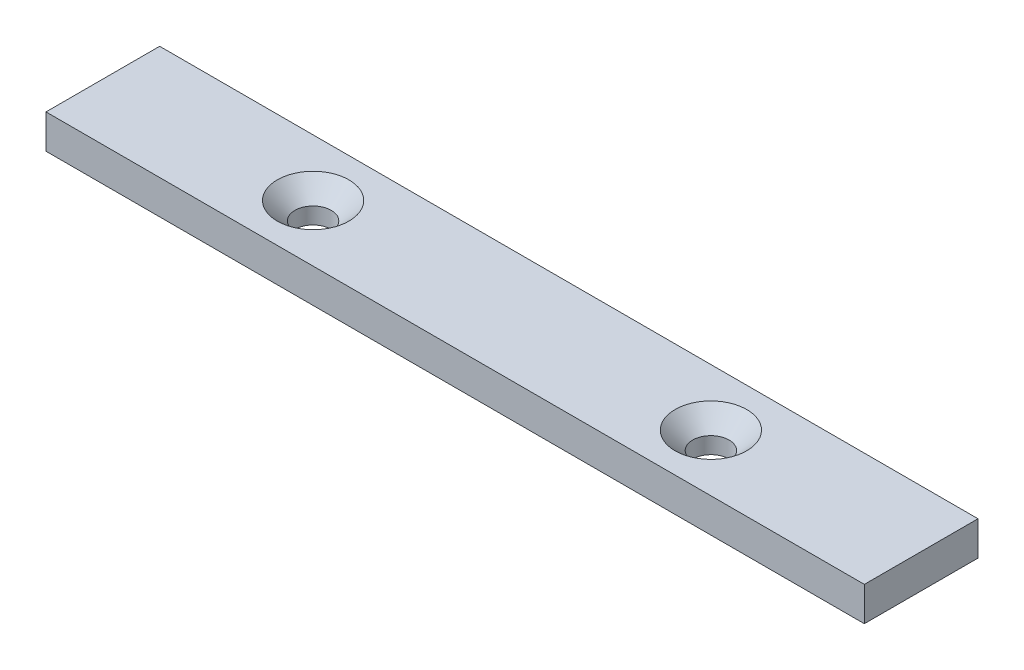
ISO-10303-21;
HEADER;
FILE_DESCRIPTION(('STEP AP214'),'2;1');
FILE_NAME('part.step','',(''),(''),'','','');
FILE_SCHEMA(('AUTOMOTIVE_DESIGN { 1 0 10303 214 1 1 1 1 }'));
ENDSEC;
DATA;
#1=APPLICATION_CONTEXT('core data for automotive mechanical design processes');
#2=APPLICATION_PROTOCOL_DEFINITION('international standard','automotive_design',2000,#1);
#3=PRODUCT_CONTEXT('',#1,'mechanical');
#4=PRODUCT('Part','Part','',(#3));
#5=PRODUCT_RELATED_PRODUCT_CATEGORY('part','',(#4));
#6=PRODUCT_DEFINITION_FORMATION('','',#4);
#7=PRODUCT_DEFINITION_CONTEXT('part definition',#1,'design');
#8=PRODUCT_DEFINITION('design','',#6,#7);
#9=PRODUCT_DEFINITION_SHAPE('','',#8);
#10=(LENGTH_UNIT() NAMED_UNIT(*) SI_UNIT(.MILLI.,.METRE.));
#11=(NAMED_UNIT(*) PLANE_ANGLE_UNIT() SI_UNIT($,.RADIAN.));
#12=(NAMED_UNIT(*) SI_UNIT($,.STERADIAN.) SOLID_ANGLE_UNIT());
#13=UNCERTAINTY_MEASURE_WITH_UNIT(LENGTH_MEASURE(1.E-05),#10,'distance_accuracy_value','');
#14=(GEOMETRIC_REPRESENTATION_CONTEXT(3) GLOBAL_UNCERTAINTY_ASSIGNED_CONTEXT((#13)) GLOBAL_UNIT_ASSIGNED_CONTEXT((#10,
#11,#12)) REPRESENTATION_CONTEXT('',''));
#15=CARTESIAN_POINT('',(0.,0.,0.));
#16=DIRECTION('',(0.,0.,1.));
#17=DIRECTION('',(1.,0.,0.));
#18=AXIS2_PLACEMENT_3D('',#15,#16,#17);
#19=CARTESIAN_POINT('',(71.9999999999999,6.,-10.));
#20=DIRECTION('',(-1.,0.,0.));
#21=DIRECTION('',(0.,0.,1.));
#22=AXIS2_PLACEMENT_3D('',#19,#20,#21);
#23=PLANE('',#22);
#24=DIRECTION('',(0.,0.,-1.));
#25=VECTOR('',#24,1.);
#26=CARTESIAN_POINT('',(71.9999999999999,0.,-10.));
#27=LINE('',#26,#25);
#28=CARTESIAN_POINT('',(71.9999999999999,0.,10.));
#29=VERTEX_POINT('',#28);
#30=CARTESIAN_POINT('',(71.9999999999999,0.,-10.));
#31=VERTEX_POINT('',#30);
#32=EDGE_CURVE('E96',#29,#31,#27,.T.);
#33=ORIENTED_EDGE('',*,*,#32,.T.);
#34=DIRECTION('',(0.,-1.,0.));
#35=VECTOR('',#34,1.);
#36=CARTESIAN_POINT('',(71.9999999999999,6.,-10.));
#37=LINE('',#36,#35);
#38=CARTESIAN_POINT('',(71.9999999999999,6.,-10.));
#39=VERTEX_POINT('',#38);
#40=EDGE_CURVE('E11',#39,#31,#37,.T.);
#41=ORIENTED_EDGE('',*,*,#40,.F.);
#42=DIRECTION('',(0.,0.,-1.));
#43=VECTOR('',#42,1.);
#44=CARTESIAN_POINT('',(71.9999999999999,6.,-10.));
#45=LINE('',#44,#43);
#46=CARTESIAN_POINT('',(71.9999999999999,6.,10.));
#47=VERTEX_POINT('',#46);
#48=EDGE_CURVE('E84',#47,#39,#45,.T.);
#49=ORIENTED_EDGE('',*,*,#48,.F.);
#50=DIRECTION('',(0.,-1.,0.));
#51=VECTOR('',#50,1.);
#52=CARTESIAN_POINT('',(71.9999999999999,6.,10.));
#53=LINE('',#52,#51);
#54=EDGE_CURVE('E92',#47,#29,#53,.T.);
#55=ORIENTED_EDGE('',*,*,#54,.T.);
#56=EDGE_LOOP('',(#33,#41,#49,#55));
#57=FACE_BOUND('',#56,.T.);
#58=ADVANCED_FACE('F33',(#57),#23,.F.);
#59=CARTESIAN_POINT('',(-72.0000000000001,6.,-10.));
#60=DIRECTION('',(0.,0.,1.));
#61=DIRECTION('',(1.,0.,0.));
#62=AXIS2_PLACEMENT_3D('',#59,#60,#61);
#63=PLANE('',#62);
#64=DIRECTION('',(-1.,0.,0.));
#65=VECTOR('',#64,1.);
#66=CARTESIAN_POINT('',(-72.0000000000001,0.,-10.));
#67=LINE('',#66,#65);
#68=CARTESIAN_POINT('',(-72.0000000000001,0.,-10.));
#69=VERTEX_POINT('',#68);
#70=EDGE_CURVE('E88',#31,#69,#67,.T.);
#71=ORIENTED_EDGE('',*,*,#70,.T.);
#72=DIRECTION('',(0.,-1.,0.));
#73=VECTOR('',#72,1.);
#74=CARTESIAN_POINT('',(-72.0000000000001,6.,-10.));
#75=LINE('',#74,#73);
#76=CARTESIAN_POINT('',(-72.0000000000001,6.,-10.));
#77=VERTEX_POINT('',#76);
#78=EDGE_CURVE('E41',#77,#69,#75,.T.);
#79=ORIENTED_EDGE('',*,*,#78,.F.);
#80=DIRECTION('',(-1.,0.,0.));
#81=VECTOR('',#80,1.);
#82=CARTESIAN_POINT('',(-72.0000000000001,6.,-10.));
#83=LINE('',#82,#81);
#84=EDGE_CURVE('E79',#39,#77,#83,.T.);
#85=ORIENTED_EDGE('',*,*,#84,.F.);
#86=ORIENTED_EDGE('',*,*,#40,.T.);
#87=EDGE_LOOP('',(#71,#79,#85,#86));
#88=FACE_BOUND('',#87,.T.);
#89=ADVANCED_FACE('F87',(#88),#63,.F.);
#90=CARTESIAN_POINT('',(-72.0000000000001,6.,-10.));
#91=DIRECTION('',(1.,0.,0.));
#92=DIRECTION('',(0.,0.,-1.));
#93=AXIS2_PLACEMENT_3D('',#90,#91,#92);
#94=PLANE('',#93);
#95=DIRECTION('',(0.,0.,1.));
#96=VECTOR('',#95,1.);
#97=CARTESIAN_POINT('',(-72.0000000000001,0.,-10.));
#98=LINE('',#97,#96);
#99=CARTESIAN_POINT('',(-72.0000000000001,0.,10.));
#100=VERTEX_POINT('',#99);
#101=EDGE_CURVE('E66',#69,#100,#98,.T.);
#102=ORIENTED_EDGE('',*,*,#101,.T.);
#103=DIRECTION('',(0.,-1.,0.));
#104=VECTOR('',#103,1.);
#105=CARTESIAN_POINT('',(-72.0000000000001,6.,10.));
#106=LINE('',#105,#104);
#107=CARTESIAN_POINT('',(-72.0000000000001,6.,10.));
#108=VERTEX_POINT('',#107);
#109=EDGE_CURVE('E89',#108,#100,#106,.T.);
#110=ORIENTED_EDGE('',*,*,#109,.F.);
#111=DIRECTION('',(0.,0.,1.));
#112=VECTOR('',#111,1.);
#113=CARTESIAN_POINT('',(-72.0000000000001,6.,-10.));
#114=LINE('',#113,#112);
#115=EDGE_CURVE('E82',#77,#108,#114,.T.);
#116=ORIENTED_EDGE('',*,*,#115,.F.);
#117=ORIENTED_EDGE('',*,*,#78,.T.);
#118=EDGE_LOOP('',(#102,#110,#116,#117));
#119=FACE_BOUND('',#118,.T.);
#120=ADVANCED_FACE('F90',(#119),#94,.F.);
#121=CARTESIAN_POINT('',(-72.0000000000001,6.,10.));
#122=DIRECTION('',(0.,0.,-1.));
#123=DIRECTION('',(-1.,0.,0.));
#124=AXIS2_PLACEMENT_3D('',#121,#122,#123);
#125=PLANE('',#124);
#126=DIRECTION('',(1.,0.,0.));
#127=VECTOR('',#126,1.);
#128=CARTESIAN_POINT('',(-72.0000000000001,0.,10.));
#129=LINE('',#128,#127);
#130=EDGE_CURVE('E72',#100,#29,#129,.T.);
#131=ORIENTED_EDGE('',*,*,#130,.T.);
#132=ORIENTED_EDGE('',*,*,#54,.F.);
#133=DIRECTION('',(1.,0.,0.));
#134=VECTOR('',#133,1.);
#135=CARTESIAN_POINT('',(-72.0000000000001,6.,10.));
#136=LINE('',#135,#134);
#137=EDGE_CURVE('E49',#108,#47,#136,.T.);
#138=ORIENTED_EDGE('',*,*,#137,.F.);
#139=ORIENTED_EDGE('',*,*,#109,.T.);
#140=EDGE_LOOP('',(#131,#132,#138,#139));
#141=FACE_BOUND('',#140,.T.);
#142=ADVANCED_FACE('F104',(#141),#125,.F.);
#143=CARTESIAN_POINT('',(0.,6.,0.));
#144=DIRECTION('',(0.,1.,0.));
#145=DIRECTION('',(0.,0.,1.));
#146=AXIS2_PLACEMENT_3D('',#143,#144,#145);
#147=PLANE('',#146);
#148=CARTESIAN_POINT('',(-35.,6.,0.));
#149=DIRECTION('',(0.,1.,0.));
#150=DIRECTION('',(0.,0.,1.));
#151=AXIS2_PLACEMENT_3D('',#148,#149,#150);
#152=CIRCLE('',#151,6.3);
#153=CARTESIAN_POINT('',(-35.,6.,6.3));
#154=VERTEX_POINT('',#153);
#155=EDGE_CURVE('E124',#154,#154,#152,.T.);
#156=ORIENTED_EDGE('',*,*,#155,.F.);
#157=EDGE_LOOP('',(#156));
#158=FACE_BOUND('',#157,.T.);
#159=CARTESIAN_POINT('',(35.,6.,0.));
#160=DIRECTION('',(0.,1.,0.));
#161=DIRECTION('',(0.,0.,1.));
#162=AXIS2_PLACEMENT_3D('',#159,#160,#161);
#163=CIRCLE('',#162,6.3);
#164=CARTESIAN_POINT('',(35.,6.,6.3));
#165=VERTEX_POINT('',#164);
#166=EDGE_CURVE('E115',#165,#165,#163,.T.);
#167=ORIENTED_EDGE('',*,*,#166,.F.);
#168=EDGE_LOOP('',(#167));
#169=FACE_BOUND('',#168,.T.);
#170=ORIENTED_EDGE('',*,*,#48,.T.);
#171=ORIENTED_EDGE('',*,*,#84,.T.);
#172=ORIENTED_EDGE('',*,*,#115,.T.);
#173=ORIENTED_EDGE('',*,*,#137,.T.);
#174=EDGE_LOOP('',(#170,#171,#172,#173));
#175=FACE_BOUND('',#174,.T.);
#176=ADVANCED_FACE('F80',(#158,#169,#175),#147,.T.);
#177=CARTESIAN_POINT('',(0.,0.,0.));
#178=DIRECTION('',(0.,1.,0.));
#179=DIRECTION('',(0.,0.,1.));
#180=AXIS2_PLACEMENT_3D('',#177,#178,#179);
#181=PLANE('',#180);
#182=CARTESIAN_POINT('',(-35.,0.,0.));
#183=DIRECTION('',(0.,1.,0.));
#184=DIRECTION('',(0.,0.,1.));
#185=AXIS2_PLACEMENT_3D('',#182,#183,#184);
#186=CIRCLE('',#185,3.2);
#187=CARTESIAN_POINT('',(-35.,0.,3.2));
#188=VERTEX_POINT('',#187);
#189=EDGE_CURVE('E118',#188,#188,#186,.T.);
#190=ORIENTED_EDGE('',*,*,#189,.T.);
#191=EDGE_LOOP('',(#190));
#192=FACE_BOUND('',#191,.T.);
#193=CARTESIAN_POINT('',(35.,0.,0.));
#194=DIRECTION('',(0.,1.,0.));
#195=DIRECTION('',(0.,0.,1.));
#196=AXIS2_PLACEMENT_3D('',#193,#194,#195);
#197=CIRCLE('',#196,3.2);
#198=CARTESIAN_POINT('',(35.,0.,3.2));
#199=VERTEX_POINT('',#198);
#200=EDGE_CURVE('E99',#199,#199,#197,.T.);
#201=ORIENTED_EDGE('',*,*,#200,.T.);
#202=EDGE_LOOP('',(#201));
#203=FACE_BOUND('',#202,.T.);
#204=ORIENTED_EDGE('',*,*,#32,.F.);
#205=ORIENTED_EDGE('',*,*,#130,.F.);
#206=ORIENTED_EDGE('',*,*,#101,.F.);
#207=ORIENTED_EDGE('',*,*,#70,.F.);
#208=EDGE_LOOP('',(#204,#205,#206,#207));
#209=FACE_BOUND('',#208,.T.);
#210=ADVANCED_FACE('F107',(#192,#203,#209),#181,.F.);
#211=CARTESIAN_POINT('',(35.,6.,0.));
#212=DIRECTION('',(0.,1.,0.));
#213=DIRECTION('',(0.,0.,1.));
#214=AXIS2_PLACEMENT_3D('',#211,#212,#213);
#215=CYLINDRICAL_SURFACE('',#214,3.2);
#216=ORIENTED_EDGE('',*,*,#200,.F.);
#217=EDGE_LOOP('',(#216));
#218=FACE_BOUND('',#217,.T.);
#219=CARTESIAN_POINT('',(35.,2.90000000000001,0.));
#220=DIRECTION('',(0.,1.,0.));
#221=DIRECTION('',(0.,0.,1.));
#222=AXIS2_PLACEMENT_3D('',#219,#220,#221);
#223=CIRCLE('',#222,3.2);
#224=CARTESIAN_POINT('',(35.,2.90000000000001,3.2));
#225=VERTEX_POINT('',#224);
#226=EDGE_CURVE('E112',#225,#225,#223,.T.);
#227=ORIENTED_EDGE('',*,*,#226,.T.);
#228=EDGE_LOOP('',(#227));
#229=FACE_BOUND('',#228,.T.);
#230=ADVANCED_FACE('F138',(#218,#229),#215,.F.);
#231=CARTESIAN_POINT('',(35.,6.,0.));
#232=DIRECTION('',(0.,1.,0.));
#233=DIRECTION('',(0.,0.,1.));
#234=AXIS2_PLACEMENT_3D('',#231,#232,#233);
#235=CONICAL_SURFACE('',#234,6.3,0.78539816339745);
#236=ORIENTED_EDGE('',*,*,#226,.F.);
#237=EDGE_LOOP('',(#236));
#238=FACE_BOUND('',#237,.T.);
#239=ORIENTED_EDGE('',*,*,#166,.T.);
#240=EDGE_LOOP('',(#239));
#241=FACE_BOUND('',#240,.T.);
#242=ADVANCED_FACE('F135',(#238,#241),#235,.F.);
#243=CARTESIAN_POINT('',(-35.,6.,0.));
#244=DIRECTION('',(0.,1.,0.));
#245=DIRECTION('',(0.,0.,1.));
#246=AXIS2_PLACEMENT_3D('',#243,#244,#245);
#247=CYLINDRICAL_SURFACE('',#246,3.2);
#248=ORIENTED_EDGE('',*,*,#189,.F.);
#249=EDGE_LOOP('',(#248));
#250=FACE_BOUND('',#249,.T.);
#251=CARTESIAN_POINT('',(-35.,2.90000000000001,0.));
#252=DIRECTION('',(0.,1.,0.));
#253=DIRECTION('',(0.,0.,1.));
#254=AXIS2_PLACEMENT_3D('',#251,#252,#253);
#255=CIRCLE('',#254,3.2);
#256=CARTESIAN_POINT('',(-35.,2.90000000000001,3.2));
#257=VERTEX_POINT('',#256);
#258=EDGE_CURVE('E121',#257,#257,#255,.T.);
#259=ORIENTED_EDGE('',*,*,#258,.T.);
#260=EDGE_LOOP('',(#259));
#261=FACE_BOUND('',#260,.T.);
#262=ADVANCED_FACE('F137',(#250,#261),#247,.F.);
#263=CARTESIAN_POINT('',(-35.,6.,0.));
#264=DIRECTION('',(0.,1.,0.));
#265=DIRECTION('',(0.,0.,1.));
#266=AXIS2_PLACEMENT_3D('',#263,#264,#265);
#267=CONICAL_SURFACE('',#266,6.3,0.78539816339745);
#268=ORIENTED_EDGE('',*,*,#258,.F.);
#269=EDGE_LOOP('',(#268));
#270=FACE_BOUND('',#269,.T.);
#271=ORIENTED_EDGE('',*,*,#155,.T.);
#272=EDGE_LOOP('',(#271));
#273=FACE_BOUND('',#272,.T.);
#274=ADVANCED_FACE('F128',(#270,#273),#267,.F.);
#275=CLOSED_SHELL('',(#58,#89,#120,#142,#176,#210,#230,#242,#262,#274));
#276=MANIFOLD_SOLID_BREP('B2',#275);
#277=ADVANCED_BREP_SHAPE_REPRESENTATION('',(#18,#276),#14);
#278=SHAPE_DEFINITION_REPRESENTATION(#9,#277);
ENDSEC;
END-ISO-10303-21;
